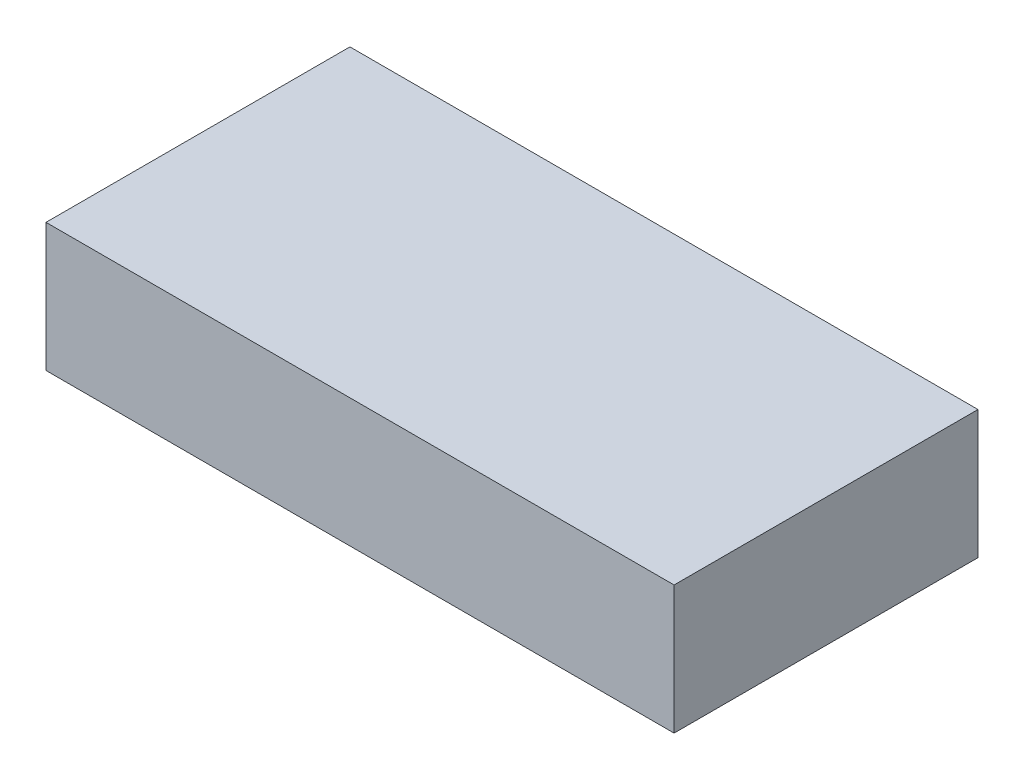
ISO-10303-21;
HEADER;
FILE_DESCRIPTION(('STEP AP214'),'2;1');
FILE_NAME('part.step','',(''),(''),'','','');
FILE_SCHEMA(('AUTOMOTIVE_DESIGN { 1 0 10303 214 1 1 1 1 }'));
ENDSEC;
DATA;
#1=APPLICATION_CONTEXT('core data for automotive mechanical design processes');
#2=APPLICATION_PROTOCOL_DEFINITION('international standard','automotive_design',2000,#1);
#3=PRODUCT_CONTEXT('',#1,'mechanical');
#4=PRODUCT('Part','Part','',(#3));
#5=PRODUCT_RELATED_PRODUCT_CATEGORY('part','',(#4));
#6=PRODUCT_DEFINITION_FORMATION('','',#4);
#7=PRODUCT_DEFINITION_CONTEXT('part definition',#1,'design');
#8=PRODUCT_DEFINITION('design','',#6,#7);
#9=PRODUCT_DEFINITION_SHAPE('','',#8);
#10=(LENGTH_UNIT() NAMED_UNIT(*) SI_UNIT(.MILLI.,.METRE.));
#11=(NAMED_UNIT(*) PLANE_ANGLE_UNIT() SI_UNIT($,.RADIAN.));
#12=(NAMED_UNIT(*) SI_UNIT($,.STERADIAN.) SOLID_ANGLE_UNIT());
#13=UNCERTAINTY_MEASURE_WITH_UNIT(LENGTH_MEASURE(1.E-05),#10,'distance_accuracy_value','');
#14=(GEOMETRIC_REPRESENTATION_CONTEXT(3) GLOBAL_UNCERTAINTY_ASSIGNED_CONTEXT((#13)) GLOBAL_UNIT_ASSIGNED_CONTEXT((#10,
#11,#12)) REPRESENTATION_CONTEXT('',''));
#15=CARTESIAN_POINT('',(0.,0.,0.));
#16=DIRECTION('',(0.,0.,1.));
#17=DIRECTION('',(1.,0.,0.));
#18=AXIS2_PLACEMENT_3D('',#15,#16,#17);
#19=CARTESIAN_POINT('',(-23.1049285714286,14.478,-12.7056696428571));
#20=DIRECTION('',(1.,0.,0.));
#21=DIRECTION('',(0.,0.,-1.));
#22=AXIS2_PLACEMENT_3D('',#19,#20,#21);
#23=PLANE('',#22);
#24=DIRECTION('',(0.,0.,1.));
#25=VECTOR('',#24,1.);
#26=CARTESIAN_POINT('',(-23.1049285714286,0.,-12.7056696428571));
#27=LINE('',#26,#25);
#28=CARTESIAN_POINT('',(-23.1049285714286,0.,-12.7056696428571));
#29=VERTEX_POINT('',#28);
#30=CARTESIAN_POINT('',(-23.1049285714286,0.,21.5843303571429));
#31=VERTEX_POINT('',#30);
#32=EDGE_CURVE('E111',#29,#31,#27,.T.);
#33=ORIENTED_EDGE('',*,*,#32,.T.);
#34=DIRECTION('',(0.,-1.,0.));
#35=VECTOR('',#34,1.);
#36=CARTESIAN_POINT('',(-23.1049285714286,14.478,21.5843303571429));
#37=LINE('',#36,#35);
#38=CARTESIAN_POINT('',(-23.1049285714286,14.478,21.5843303571429));
#39=VERTEX_POINT('',#38);
#40=EDGE_CURVE('E11',#39,#31,#37,.T.);
#41=ORIENTED_EDGE('',*,*,#40,.F.);
#42=DIRECTION('',(0.,0.,1.));
#43=VECTOR('',#42,1.);
#44=CARTESIAN_POINT('',(-23.1049285714286,14.478,-12.7056696428571));
#45=LINE('',#44,#43);
#46=CARTESIAN_POINT('',(-23.1049285714286,14.478,-12.7056696428571));
#47=VERTEX_POINT('',#46);
#48=EDGE_CURVE('E95',#47,#39,#45,.T.);
#49=ORIENTED_EDGE('',*,*,#48,.F.);
#50=DIRECTION('',(0.,-1.,0.));
#51=VECTOR('',#50,1.);
#52=CARTESIAN_POINT('',(-23.1049285714286,14.478,-12.7056696428571));
#53=LINE('',#52,#51);
#54=EDGE_CURVE('E107',#47,#29,#53,.T.);
#55=ORIENTED_EDGE('',*,*,#54,.T.);
#56=EDGE_LOOP('',(#33,#41,#49,#55));
#57=FACE_BOUND('',#56,.T.);
#58=ADVANCED_FACE('F43',(#57),#23,.F.);
#59=CARTESIAN_POINT('',(-23.1049285714286,14.478,21.5843303571429));
#60=DIRECTION('',(0.,0.,-1.));
#61=DIRECTION('',(-1.,0.,0.));
#62=AXIS2_PLACEMENT_3D('',#59,#60,#61);
#63=PLANE('',#62);
#64=DIRECTION('',(1.,0.,0.));
#65=VECTOR('',#64,1.);
#66=CARTESIAN_POINT('',(-23.1049285714286,0.,21.5843303571429));
#67=LINE('',#66,#65);
#68=CARTESIAN_POINT('',(47.7610714285714,0.,21.5843303571429));
#69=VERTEX_POINT('',#68);
#70=EDGE_CURVE('E100',#31,#69,#67,.T.);
#71=ORIENTED_EDGE('',*,*,#70,.T.);
#72=DIRECTION('',(0.,-1.,0.));
#73=VECTOR('',#72,1.);
#74=CARTESIAN_POINT('',(47.7610714285714,14.478,21.5843303571429));
#75=LINE('',#74,#73);
#76=CARTESIAN_POINT('',(47.7610714285714,14.478,21.5843303571429));
#77=VERTEX_POINT('',#76);
#78=EDGE_CURVE('E52',#77,#69,#75,.T.);
#79=ORIENTED_EDGE('',*,*,#78,.F.);
#80=DIRECTION('',(1.,0.,0.));
#81=VECTOR('',#80,1.);
#82=CARTESIAN_POINT('',(-23.1049285714286,14.478,21.5843303571429));
#83=LINE('',#82,#81);
#84=EDGE_CURVE('E90',#39,#77,#83,.T.);
#85=ORIENTED_EDGE('',*,*,#84,.F.);
#86=ORIENTED_EDGE('',*,*,#40,.T.);
#87=EDGE_LOOP('',(#71,#79,#85,#86));
#88=FACE_BOUND('',#87,.T.);
#89=ADVANCED_FACE('F99',(#88),#63,.F.);
#90=CARTESIAN_POINT('',(47.7610714285714,14.478,-12.7056696428571));
#91=DIRECTION('',(-1.,0.,0.));
#92=DIRECTION('',(0.,0.,1.));
#93=AXIS2_PLACEMENT_3D('',#90,#91,#92);
#94=PLANE('',#93);
#95=DIRECTION('',(0.,0.,-1.));
#96=VECTOR('',#95,1.);
#97=CARTESIAN_POINT('',(47.7610714285714,0.,-12.7056696428571));
#98=LINE('',#97,#96);
#99=CARTESIAN_POINT('',(47.7610714285714,0.,-12.7056696428571));
#100=VERTEX_POINT('',#99);
#101=EDGE_CURVE('E77',#69,#100,#98,.T.);
#102=ORIENTED_EDGE('',*,*,#101,.T.);
#103=DIRECTION('',(0.,-1.,0.));
#104=VECTOR('',#103,1.);
#105=CARTESIAN_POINT('',(47.7610714285714,14.478,-12.7056696428571));
#106=LINE('',#105,#104);
#107=CARTESIAN_POINT('',(47.7610714285714,14.478,-12.7056696428571));
#108=VERTEX_POINT('',#107);
#109=EDGE_CURVE('E102',#108,#100,#106,.T.);
#110=ORIENTED_EDGE('',*,*,#109,.F.);
#111=DIRECTION('',(0.,0.,-1.));
#112=VECTOR('',#111,1.);
#113=CARTESIAN_POINT('',(47.7610714285714,14.478,-12.7056696428571));
#114=LINE('',#113,#112);
#115=EDGE_CURVE('E93',#77,#108,#114,.T.);
#116=ORIENTED_EDGE('',*,*,#115,.F.);
#117=ORIENTED_EDGE('',*,*,#78,.T.);
#118=EDGE_LOOP('',(#102,#110,#116,#117));
#119=FACE_BOUND('',#118,.T.);
#120=ADVANCED_FACE('F103',(#119),#94,.F.);
#121=CARTESIAN_POINT('',(-23.1049285714286,14.478,-12.7056696428571));
#122=DIRECTION('',(0.,0.,1.));
#123=DIRECTION('',(1.,0.,0.));
#124=AXIS2_PLACEMENT_3D('',#121,#122,#123);
#125=PLANE('',#124);
#126=DIRECTION('',(-1.,0.,0.));
#127=VECTOR('',#126,1.);
#128=CARTESIAN_POINT('',(-23.1049285714286,0.,-12.7056696428571));
#129=LINE('',#128,#127);
#130=EDGE_CURVE('E83',#100,#29,#129,.T.);
#131=ORIENTED_EDGE('',*,*,#130,.T.);
#132=ORIENTED_EDGE('',*,*,#54,.F.);
#133=DIRECTION('',(-1.,0.,0.));
#134=VECTOR('',#133,1.);
#135=CARTESIAN_POINT('',(-23.1049285714286,14.478,-12.7056696428571));
#136=LINE('',#135,#134);
#137=EDGE_CURVE('E60',#108,#47,#136,.T.);
#138=ORIENTED_EDGE('',*,*,#137,.F.);
#139=ORIENTED_EDGE('',*,*,#109,.T.);
#140=EDGE_LOOP('',(#131,#132,#138,#139));
#141=FACE_BOUND('',#140,.T.);
#142=ADVANCED_FACE('F124',(#141),#125,.F.);
#143=CARTESIAN_POINT('',(0.,14.478,0.));
#144=DIRECTION('',(0.,1.,0.));
#145=DIRECTION('',(0.,0.,1.));
#146=AXIS2_PLACEMENT_3D('',#143,#144,#145);
#147=PLANE('',#146);
#148=ORIENTED_EDGE('',*,*,#48,.T.);
#149=ORIENTED_EDGE('',*,*,#84,.T.);
#150=ORIENTED_EDGE('',*,*,#115,.T.);
#151=ORIENTED_EDGE('',*,*,#137,.T.);
#152=EDGE_LOOP('',(#148,#149,#150,#151));
#153=FACE_BOUND('',#152,.T.);
#154=ADVANCED_FACE('F91',(#153),#147,.T.);
#155=CARTESIAN_POINT('',(0.,0.,0.));
#156=DIRECTION('',(0.,1.,0.));
#157=DIRECTION('',(0.,0.,1.));
#158=AXIS2_PLACEMENT_3D('',#155,#156,#157);
#159=PLANE('',#158);
#160=ORIENTED_EDGE('',*,*,#32,.F.);
#161=ORIENTED_EDGE('',*,*,#130,.F.);
#162=ORIENTED_EDGE('',*,*,#101,.F.);
#163=ORIENTED_EDGE('',*,*,#70,.F.);
#164=EDGE_LOOP('',(#160,#161,#162,#163));
#165=FACE_BOUND('',#164,.T.);
#166=ADVANCED_FACE('F127',(#165),#159,.F.);
#167=CLOSED_SHELL('',(#58,#89,#120,#142,#154,#166));
#168=MANIFOLD_SOLID_BREP('B2',#167);
#169=ADVANCED_BREP_SHAPE_REPRESENTATION('',(#18,#168),#14);
#170=SHAPE_DEFINITION_REPRESENTATION(#9,#169);
ENDSEC;
END-ISO-10303-21;
